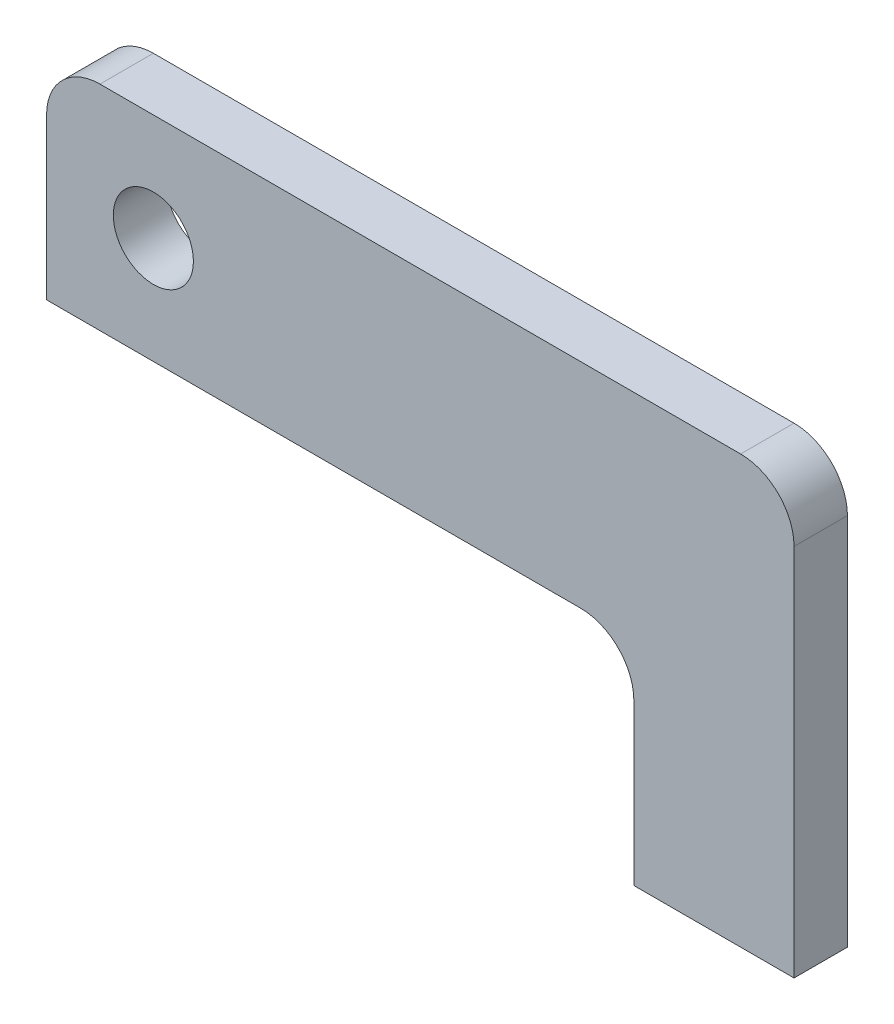
ISO-10303-21;
HEADER;
FILE_DESCRIPTION(('STEP AP214'),'2;1');
FILE_NAME('part.step','',(''),(''),'','','');
FILE_SCHEMA(('AUTOMOTIVE_DESIGN { 1 0 10303 214 1 1 1 1 }'));
ENDSEC;
DATA;
#1=APPLICATION_CONTEXT('core data for automotive mechanical design processes');
#2=APPLICATION_PROTOCOL_DEFINITION('international standard','automotive_design',2000,#1);
#3=PRODUCT_CONTEXT('',#1,'mechanical');
#4=PRODUCT('Part','Part','',(#3));
#5=PRODUCT_RELATED_PRODUCT_CATEGORY('part','',(#4));
#6=PRODUCT_DEFINITION_FORMATION('','',#4);
#7=PRODUCT_DEFINITION_CONTEXT('part definition',#1,'design');
#8=PRODUCT_DEFINITION('design','',#6,#7);
#9=PRODUCT_DEFINITION_SHAPE('','',#8);
#10=(LENGTH_UNIT() NAMED_UNIT(*) SI_UNIT(.MILLI.,.METRE.));
#11=(NAMED_UNIT(*) PLANE_ANGLE_UNIT() SI_UNIT($,.RADIAN.));
#12=(NAMED_UNIT(*) SI_UNIT($,.STERADIAN.) SOLID_ANGLE_UNIT());
#13=UNCERTAINTY_MEASURE_WITH_UNIT(LENGTH_MEASURE(1.E-05),#10,'distance_accuracy_value','');
#14=(GEOMETRIC_REPRESENTATION_CONTEXT(3) GLOBAL_UNCERTAINTY_ASSIGNED_CONTEXT((#13)) GLOBAL_UNIT_ASSIGNED_CONTEXT((#10,
#11,#12)) REPRESENTATION_CONTEXT('',''));
#15=CARTESIAN_POINT('',(0.,0.,0.));
#16=DIRECTION('',(0.,0.,1.));
#17=DIRECTION('',(1.,0.,0.));
#18=AXIS2_PLACEMENT_3D('',#15,#16,#17);
#19=CARTESIAN_POINT('',(0.,0.,6.35));
#20=DIRECTION('',(0.,-1.,0.));
#21=DIRECTION('',(1.,0.,0.));
#22=AXIS2_PLACEMENT_3D('',#19,#20,#21);
#23=PLANE('',#22);
#24=DIRECTION('',(-1.,0.,0.));
#25=VECTOR('',#24,1.);
#26=CARTESIAN_POINT('',(0.,0.,0.));
#27=LINE('',#26,#25);
#28=CARTESIAN_POINT('',(63.5,0.,0.));
#29=VERTEX_POINT('',#28);
#30=CARTESIAN_POINT('',(0.,0.,0.));
#31=VERTEX_POINT('',#30);
#32=EDGE_CURVE('E154',#29,#31,#27,.T.);
#33=ORIENTED_EDGE('',*,*,#32,.F.);
#34=DIRECTION('',(0.,0.,-1.));
#35=VECTOR('',#34,1.);
#36=CARTESIAN_POINT('',(63.5,0.,6.35));
#37=LINE('',#36,#35);
#38=CARTESIAN_POINT('',(63.5,0.,6.35));
#39=VERTEX_POINT('',#38);
#40=EDGE_CURVE('E11',#39,#29,#37,.T.);
#41=ORIENTED_EDGE('',*,*,#40,.F.);
#42=DIRECTION('',(-1.,0.,0.));
#43=VECTOR('',#42,1.);
#44=CARTESIAN_POINT('',(0.,0.,6.35));
#45=LINE('',#44,#43);
#46=CARTESIAN_POINT('',(0.,0.,6.35));
#47=VERTEX_POINT('',#46);
#48=EDGE_CURVE('E190',#39,#47,#45,.T.);
#49=ORIENTED_EDGE('',*,*,#48,.T.);
#50=DIRECTION('',(0.,0.,-1.));
#51=VECTOR('',#50,1.);
#52=CARTESIAN_POINT('',(0.,0.,6.35));
#53=LINE('',#52,#51);
#54=EDGE_CURVE('E62',#47,#31,#53,.T.);
#55=ORIENTED_EDGE('',*,*,#54,.T.);
#56=EDGE_LOOP('',(#33,#41,#49,#55));
#57=FACE_BOUND('',#56,.T.);
#58=ADVANCED_FACE('F45',(#57),#23,.T.);
#59=CARTESIAN_POINT('',(63.5,-6.35,6.35));
#60=DIRECTION('',(0.,0.,-1.));
#61=DIRECTION('',(-1.,0.,0.));
#62=AXIS2_PLACEMENT_3D('',#59,#60,#61);
#63=CYLINDRICAL_SURFACE('',#62,6.35);
#64=CARTESIAN_POINT('',(63.5,-6.35,0.));
#65=DIRECTION('',(0.,0.,1.));
#66=DIRECTION('',(1.,0.,0.));
#67=AXIS2_PLACEMENT_3D('',#64,#65,#66);
#68=CIRCLE('',#67,6.35);
#69=CARTESIAN_POINT('',(69.85,-6.35,0.));
#70=VERTEX_POINT('',#69);
#71=EDGE_CURVE('E157',#70,#29,#68,.T.);
#72=ORIENTED_EDGE('',*,*,#71,.F.);
#73=DIRECTION('',(0.,0.,-1.));
#74=VECTOR('',#73,1.);
#75=CARTESIAN_POINT('',(69.85,-6.35,6.35));
#76=LINE('',#75,#74);
#77=CARTESIAN_POINT('',(69.85,-6.35,6.35));
#78=VERTEX_POINT('',#77);
#79=EDGE_CURVE('E54',#78,#70,#76,.T.);
#80=ORIENTED_EDGE('',*,*,#79,.F.);
#81=CARTESIAN_POINT('',(63.5,-6.35,6.35));
#82=DIRECTION('',(0.,0.,1.));
#83=DIRECTION('',(1.,0.,0.));
#84=AXIS2_PLACEMENT_3D('',#81,#82,#83);
#85=CIRCLE('',#84,6.35);
#86=EDGE_CURVE('E228',#78,#39,#85,.T.);
#87=ORIENTED_EDGE('',*,*,#86,.T.);
#88=ORIENTED_EDGE('',*,*,#40,.T.);
#89=EDGE_LOOP('',(#72,#80,#87,#88));
#90=FACE_BOUND('',#89,.T.);
#91=ADVANCED_FACE('F216',(#90),#63,.F.);
#92=CARTESIAN_POINT('',(69.85,0.,6.35));
#93=DIRECTION('',(-1.,0.,0.));
#94=DIRECTION('',(0.,-1.,0.));
#95=AXIS2_PLACEMENT_3D('',#92,#93,#94);
#96=PLANE('',#95);
#97=DIRECTION('',(0.,1.,0.));
#98=VECTOR('',#97,1.);
#99=CARTESIAN_POINT('',(69.85,0.,0.));
#100=LINE('',#99,#98);
#101=CARTESIAN_POINT('',(69.85,-25.4,0.));
#102=VERTEX_POINT('',#101);
#103=EDGE_CURVE('E161',#102,#70,#100,.T.);
#104=ORIENTED_EDGE('',*,*,#103,.F.);
#105=DIRECTION('',(0.,0.,-1.));
#106=VECTOR('',#105,1.);
#107=CARTESIAN_POINT('',(69.85,-25.4,6.35));
#108=LINE('',#107,#106);
#109=CARTESIAN_POINT('',(69.85,-25.4,6.35));
#110=VERTEX_POINT('',#109);
#111=EDGE_CURVE('E203',#110,#102,#108,.T.);
#112=ORIENTED_EDGE('',*,*,#111,.F.);
#113=DIRECTION('',(0.,1.,0.));
#114=VECTOR('',#113,1.);
#115=CARTESIAN_POINT('',(69.85,0.,6.35));
#116=LINE('',#115,#114);
#117=EDGE_CURVE('E212',#110,#78,#116,.T.);
#118=ORIENTED_EDGE('',*,*,#117,.T.);
#119=ORIENTED_EDGE('',*,*,#79,.T.);
#120=EDGE_LOOP('',(#104,#112,#118,#119));
#121=FACE_BOUND('',#120,.T.);
#122=ADVANCED_FACE('F210',(#121),#96,.T.);
#123=CARTESIAN_POINT('',(0.,-25.4,6.35));
#124=DIRECTION('',(0.,-1.,0.));
#125=DIRECTION('',(1.,0.,0.));
#126=AXIS2_PLACEMENT_3D('',#123,#124,#125);
#127=PLANE('',#126);
#128=DIRECTION('',(-1.,0.,0.));
#129=VECTOR('',#128,1.);
#130=CARTESIAN_POINT('',(0.,-25.4,0.));
#131=LINE('',#130,#129);
#132=CARTESIAN_POINT('',(88.9,-25.4,0.));
#133=VERTEX_POINT('',#132);
#134=EDGE_CURVE('E165',#133,#102,#131,.T.);
#135=ORIENTED_EDGE('',*,*,#134,.F.);
#136=DIRECTION('',(0.,0.,-1.));
#137=VECTOR('',#136,1.);
#138=CARTESIAN_POINT('',(88.9,-25.4,6.35));
#139=LINE('',#138,#137);
#140=CARTESIAN_POINT('',(88.9,-25.4,6.35));
#141=VERTEX_POINT('',#140);
#142=EDGE_CURVE('E200',#141,#133,#139,.T.);
#143=ORIENTED_EDGE('',*,*,#142,.F.);
#144=DIRECTION('',(-1.,0.,0.));
#145=VECTOR('',#144,1.);
#146=CARTESIAN_POINT('',(0.,-25.4,6.35));
#147=LINE('',#146,#145);
#148=EDGE_CURVE('E226',#141,#110,#147,.T.);
#149=ORIENTED_EDGE('',*,*,#148,.T.);
#150=ORIENTED_EDGE('',*,*,#111,.T.);
#151=EDGE_LOOP('',(#135,#143,#149,#150));
#152=FACE_BOUND('',#151,.T.);
#153=ADVANCED_FACE('F223',(#152),#127,.T.);
#154=CARTESIAN_POINT('',(88.9,0.,6.35));
#155=DIRECTION('',(1.,0.,0.));
#156=DIRECTION('',(0.,0.,-1.));
#157=AXIS2_PLACEMENT_3D('',#154,#155,#156);
#158=PLANE('',#157);
#159=DIRECTION('',(0.,-1.,0.));
#160=VECTOR('',#159,1.);
#161=CARTESIAN_POINT('',(88.9,0.,0.));
#162=LINE('',#161,#160);
#163=CARTESIAN_POINT('',(88.9,19.05,0.));
#164=VERTEX_POINT('',#163);
#165=EDGE_CURVE('E169',#164,#133,#162,.T.);
#166=ORIENTED_EDGE('',*,*,#165,.F.);
#167=DIRECTION('',(0.,0.,-1.));
#168=VECTOR('',#167,1.);
#169=CARTESIAN_POINT('',(88.9,19.05,6.35));
#170=LINE('',#169,#168);
#171=CARTESIAN_POINT('',(88.9,19.05,6.35));
#172=VERTEX_POINT('',#171);
#173=EDGE_CURVE('E197',#172,#164,#170,.T.);
#174=ORIENTED_EDGE('',*,*,#173,.F.);
#175=DIRECTION('',(0.,-1.,0.));
#176=VECTOR('',#175,1.);
#177=CARTESIAN_POINT('',(88.9,0.,6.35));
#178=LINE('',#177,#176);
#179=EDGE_CURVE('E233',#172,#141,#178,.T.);
#180=ORIENTED_EDGE('',*,*,#179,.T.);
#181=ORIENTED_EDGE('',*,*,#142,.T.);
#182=EDGE_LOOP('',(#166,#174,#180,#181));
#183=FACE_BOUND('',#182,.T.);
#184=ADVANCED_FACE('F265',(#183),#158,.T.);
#185=CARTESIAN_POINT('',(82.55,19.05,6.35));
#186=DIRECTION('',(0.,0.,-1.));
#187=DIRECTION('',(-1.,0.,0.));
#188=AXIS2_PLACEMENT_3D('',#185,#186,#187);
#189=CYLINDRICAL_SURFACE('',#188,6.35);
#190=CARTESIAN_POINT('',(82.55,19.05,0.));
#191=DIRECTION('',(0.,0.,1.));
#192=DIRECTION('',(1.,0.,0.));
#193=AXIS2_PLACEMENT_3D('',#190,#191,#192);
#194=CIRCLE('',#193,6.35);
#195=CARTESIAN_POINT('',(82.55,25.4,0.));
#196=VERTEX_POINT('',#195);
#197=EDGE_CURVE('E173',#196,#164,#194,.F.);
#198=ORIENTED_EDGE('',*,*,#197,.F.);
#199=DIRECTION('',(0.,0.,-1.));
#200=VECTOR('',#199,1.);
#201=CARTESIAN_POINT('',(82.55,25.4,6.35));
#202=LINE('',#201,#200);
#203=CARTESIAN_POINT('',(82.55,25.4,6.35));
#204=VERTEX_POINT('',#203);
#205=EDGE_CURVE('E128',#204,#196,#202,.T.);
#206=ORIENTED_EDGE('',*,*,#205,.F.);
#207=CARTESIAN_POINT('',(82.55,19.05,6.35));
#208=DIRECTION('',(0.,0.,1.));
#209=DIRECTION('',(1.,0.,0.));
#210=AXIS2_PLACEMENT_3D('',#207,#208,#209);
#211=CIRCLE('',#210,6.35);
#212=EDGE_CURVE('E139',#204,#172,#211,.F.);
#213=ORIENTED_EDGE('',*,*,#212,.T.);
#214=ORIENTED_EDGE('',*,*,#173,.T.);
#215=EDGE_LOOP('',(#198,#206,#213,#214));
#216=FACE_BOUND('',#215,.T.);
#217=ADVANCED_FACE('F242',(#216),#189,.T.);
#218=CARTESIAN_POINT('',(0.,25.4,6.35));
#219=DIRECTION('',(0.,1.,0.));
#220=DIRECTION('',(-1.,0.,0.));
#221=AXIS2_PLACEMENT_3D('',#218,#219,#220);
#222=PLANE('',#221);
#223=DIRECTION('',(1.,0.,0.));
#224=VECTOR('',#223,1.);
#225=CARTESIAN_POINT('',(0.,25.4,0.));
#226=LINE('',#225,#224);
#227=CARTESIAN_POINT('',(6.35,25.4,0.));
#228=VERTEX_POINT('',#227);
#229=EDGE_CURVE('E123',#228,#196,#226,.T.);
#230=ORIENTED_EDGE('',*,*,#229,.F.);
#231=DIRECTION('',(0.,0.,-1.));
#232=VECTOR('',#231,1.);
#233=CARTESIAN_POINT('',(6.35,25.4,6.35));
#234=LINE('',#233,#232);
#235=CARTESIAN_POINT('',(6.35,25.4,6.35));
#236=VERTEX_POINT('',#235);
#237=EDGE_CURVE('E118',#236,#228,#234,.T.);
#238=ORIENTED_EDGE('',*,*,#237,.F.);
#239=DIRECTION('',(1.,0.,0.));
#240=VECTOR('',#239,1.);
#241=CARTESIAN_POINT('',(0.,25.4,6.35));
#242=LINE('',#241,#240);
#243=EDGE_CURVE('E121',#236,#204,#242,.T.);
#244=ORIENTED_EDGE('',*,*,#243,.T.);
#245=ORIENTED_EDGE('',*,*,#205,.T.);
#246=EDGE_LOOP('',(#230,#238,#244,#245));
#247=FACE_BOUND('',#246,.T.);
#248=ADVANCED_FACE('F120',(#247),#222,.T.);
#249=CARTESIAN_POINT('',(6.35,19.05,6.35));
#250=DIRECTION('',(0.,0.,-1.));
#251=DIRECTION('',(-1.,0.,0.));
#252=AXIS2_PLACEMENT_3D('',#249,#250,#251);
#253=CYLINDRICAL_SURFACE('',#252,6.35);
#254=CARTESIAN_POINT('',(6.35,19.05,0.));
#255=DIRECTION('',(0.,0.,1.));
#256=DIRECTION('',(1.,0.,0.));
#257=AXIS2_PLACEMENT_3D('',#254,#255,#256);
#258=CIRCLE('',#257,6.35);
#259=CARTESIAN_POINT('',(0.,19.05,0.));
#260=VERTEX_POINT('',#259);
#261=EDGE_CURVE('E179',#260,#228,#258,.F.);
#262=ORIENTED_EDGE('',*,*,#261,.F.);
#263=DIRECTION('',(0.,0.,-1.));
#264=VECTOR('',#263,1.);
#265=CARTESIAN_POINT('',(0.,19.05,6.35));
#266=LINE('',#265,#264);
#267=CARTESIAN_POINT('',(0.,19.05,6.35));
#268=VERTEX_POINT('',#267);
#269=EDGE_CURVE('E90',#268,#260,#266,.T.);
#270=ORIENTED_EDGE('',*,*,#269,.F.);
#271=CARTESIAN_POINT('',(6.35,19.05,6.35));
#272=DIRECTION('',(0.,0.,1.));
#273=DIRECTION('',(1.,0.,0.));
#274=AXIS2_PLACEMENT_3D('',#271,#272,#273);
#275=CIRCLE('',#274,6.35);
#276=EDGE_CURVE('E136',#268,#236,#275,.F.);
#277=ORIENTED_EDGE('',*,*,#276,.T.);
#278=ORIENTED_EDGE('',*,*,#237,.T.);
#279=EDGE_LOOP('',(#262,#270,#277,#278));
#280=FACE_BOUND('',#279,.T.);
#281=ADVANCED_FACE('F142',(#280),#253,.T.);
#282=CARTESIAN_POINT('',(0.,0.,6.35));
#283=DIRECTION('',(-1.,0.,0.));
#284=DIRECTION('',(0.,0.,1.));
#285=AXIS2_PLACEMENT_3D('',#282,#283,#284);
#286=PLANE('',#285);
#287=DIRECTION('',(0.,1.,0.));
#288=VECTOR('',#287,1.);
#289=CARTESIAN_POINT('',(0.,0.,0.));
#290=LINE('',#289,#288);
#291=EDGE_CURVE('E182',#31,#260,#290,.T.);
#292=ORIENTED_EDGE('',*,*,#291,.F.);
#293=ORIENTED_EDGE('',*,*,#54,.F.);
#294=DIRECTION('',(0.,1.,0.));
#295=VECTOR('',#294,1.);
#296=CARTESIAN_POINT('',(0.,0.,6.35));
#297=LINE('',#296,#295);
#298=EDGE_CURVE('E144',#47,#268,#297,.T.);
#299=ORIENTED_EDGE('',*,*,#298,.T.);
#300=ORIENTED_EDGE('',*,*,#269,.T.);
#301=EDGE_LOOP('',(#292,#293,#299,#300));
#302=FACE_BOUND('',#301,.T.);
#303=ADVANCED_FACE('F243',(#302),#286,.T.);
#304=CARTESIAN_POINT('',(12.7,12.7,6.35));
#305=DIRECTION('',(0.,0.,-1.));
#306=DIRECTION('',(-1.,0.,0.));
#307=AXIS2_PLACEMENT_3D('',#304,#305,#306);
#308=CYLINDRICAL_SURFACE('',#307,4.7625);
#309=CARTESIAN_POINT('',(12.7,12.7,6.35));
#310=DIRECTION('',(0.,0.,1.));
#311=DIRECTION('',(1.,0.,0.));
#312=AXIS2_PLACEMENT_3D('',#309,#310,#311);
#313=CIRCLE('',#312,4.7625);
#314=CARTESIAN_POINT('',(17.4625,12.7,6.35));
#315=VERTEX_POINT('',#314);
#316=EDGE_CURVE('E147',#315,#315,#313,.T.);
#317=ORIENTED_EDGE('',*,*,#316,.T.);
#318=EDGE_LOOP('',(#317));
#319=FACE_BOUND('',#318,.T.);
#320=CARTESIAN_POINT('',(12.7,12.7,0.));
#321=DIRECTION('',(0.,0.,1.));
#322=DIRECTION('',(1.,0.,0.));
#323=AXIS2_PLACEMENT_3D('',#320,#321,#322);
#324=CIRCLE('',#323,4.7625);
#325=CARTESIAN_POINT('',(17.4625,12.7,0.));
#326=VERTEX_POINT('',#325);
#327=EDGE_CURVE('E186',#326,#326,#324,.T.);
#328=ORIENTED_EDGE('',*,*,#327,.F.);
#329=EDGE_LOOP('',(#328));
#330=FACE_BOUND('',#329,.T.);
#331=ADVANCED_FACE('F245',(#319,#330),#308,.F.);
#332=CARTESIAN_POINT('',(0.,0.,6.35));
#333=DIRECTION('',(0.,0.,1.));
#334=DIRECTION('',(1.,0.,0.));
#335=AXIS2_PLACEMENT_3D('',#332,#333,#334);
#336=PLANE('',#335);
#337=ORIENTED_EDGE('',*,*,#48,.F.);
#338=ORIENTED_EDGE('',*,*,#86,.F.);
#339=ORIENTED_EDGE('',*,*,#117,.F.);
#340=ORIENTED_EDGE('',*,*,#148,.F.);
#341=ORIENTED_EDGE('',*,*,#179,.F.);
#342=ORIENTED_EDGE('',*,*,#212,.F.);
#343=ORIENTED_EDGE('',*,*,#243,.F.);
#344=ORIENTED_EDGE('',*,*,#276,.F.);
#345=ORIENTED_EDGE('',*,*,#298,.F.);
#346=EDGE_LOOP('',(#337,#338,#339,#340,#341,#342,#343,#344,#345));
#347=FACE_BOUND('',#346,.T.);
#348=ORIENTED_EDGE('',*,*,#316,.F.);
#349=EDGE_LOOP('',(#348));
#350=FACE_BOUND('',#349,.T.);
#351=ADVANCED_FACE('F133',(#347,#350),#336,.T.);
#352=CARTESIAN_POINT('',(0.,0.,0.));
#353=DIRECTION('',(0.,0.,1.));
#354=DIRECTION('',(1.,0.,0.));
#355=AXIS2_PLACEMENT_3D('',#352,#353,#354);
#356=PLANE('',#355);
#357=ORIENTED_EDGE('',*,*,#32,.T.);
#358=ORIENTED_EDGE('',*,*,#291,.T.);
#359=ORIENTED_EDGE('',*,*,#261,.T.);
#360=ORIENTED_EDGE('',*,*,#229,.T.);
#361=ORIENTED_EDGE('',*,*,#197,.T.);
#362=ORIENTED_EDGE('',*,*,#165,.T.);
#363=ORIENTED_EDGE('',*,*,#134,.T.);
#364=ORIENTED_EDGE('',*,*,#103,.T.);
#365=ORIENTED_EDGE('',*,*,#71,.T.);
#366=EDGE_LOOP('',(#357,#358,#359,#360,#361,#362,#363,#364,#365));
#367=FACE_BOUND('',#366,.T.);
#368=ORIENTED_EDGE('',*,*,#327,.T.);
#369=EDGE_LOOP('',(#368));
#370=FACE_BOUND('',#369,.T.);
#371=ADVANCED_FACE('F218',(#367,#370),#356,.F.);
#372=CLOSED_SHELL('',(#58,#91,#122,#153,#184,#217,#248,#281,#303,#331,#351,#371));
#373=MANIFOLD_SOLID_BREP('B2',#372);
#374=ADVANCED_BREP_SHAPE_REPRESENTATION('',(#18,#373),#14);
#375=SHAPE_DEFINITION_REPRESENTATION(#9,#374);
ENDSEC;
END-ISO-10303-21;
